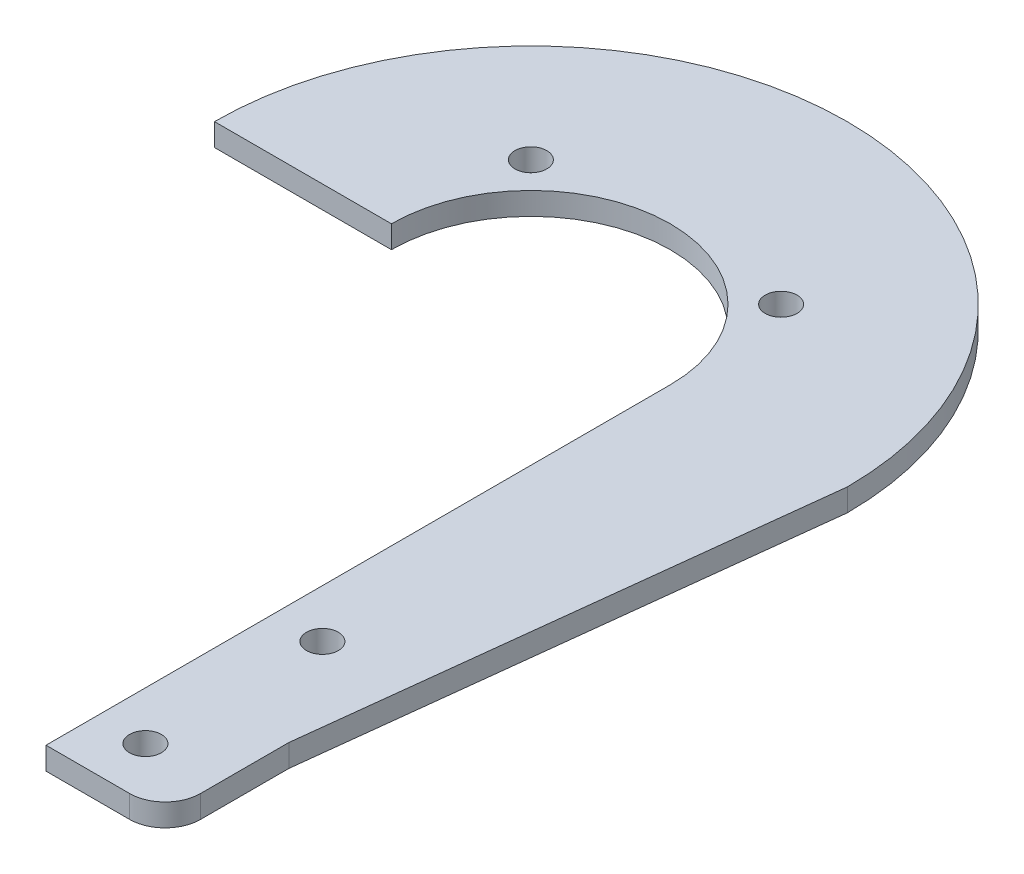
ISO-10303-21;
HEADER;
FILE_DESCRIPTION(('STEP AP214'),'2;1');
FILE_NAME('part.step','',(''),(''),'','','');
FILE_SCHEMA(('AUTOMOTIVE_DESIGN { 1 0 10303 214 1 1 1 1 }'));
ENDSEC;
DATA;
#1=APPLICATION_CONTEXT('core data for automotive mechanical design processes');
#2=APPLICATION_PROTOCOL_DEFINITION('international standard','automotive_design',2000,#1);
#3=PRODUCT_CONTEXT('',#1,'mechanical');
#4=PRODUCT('Part','Part','',(#3));
#5=PRODUCT_RELATED_PRODUCT_CATEGORY('part','',(#4));
#6=PRODUCT_DEFINITION_FORMATION('','',#4);
#7=PRODUCT_DEFINITION_CONTEXT('part definition',#1,'design');
#8=PRODUCT_DEFINITION('design','',#6,#7);
#9=PRODUCT_DEFINITION_SHAPE('','',#8);
#10=(LENGTH_UNIT() NAMED_UNIT(*) SI_UNIT(.MILLI.,.METRE.));
#11=(NAMED_UNIT(*) PLANE_ANGLE_UNIT() SI_UNIT($,.RADIAN.));
#12=(NAMED_UNIT(*) SI_UNIT($,.STERADIAN.) SOLID_ANGLE_UNIT());
#13=UNCERTAINTY_MEASURE_WITH_UNIT(LENGTH_MEASURE(1.E-05),#10,'distance_accuracy_value','');
#14=(GEOMETRIC_REPRESENTATION_CONTEXT(3) GLOBAL_UNCERTAINTY_ASSIGNED_CONTEXT((#13)) GLOBAL_UNIT_ASSIGNED_CONTEXT((#10,
#11,#12)) REPRESENTATION_CONTEXT('',''));
#15=CARTESIAN_POINT('',(0.,0.,0.));
#16=DIRECTION('',(0.,0.,1.));
#17=DIRECTION('',(1.,0.,0.));
#18=AXIS2_PLACEMENT_3D('',#15,#16,#17);
#19=CARTESIAN_POINT('',(0.,3.175,0.));
#20=DIRECTION('',(0.,1.,0.));
#21=DIRECTION('',(0.,0.,1.));
#22=AXIS2_PLACEMENT_3D('',#19,#20,#21);
#23=PLANE('',#22);
#24=CARTESIAN_POINT('',(17.6776695296637,3.175,-17.6776695296637));
#25=DIRECTION('',(0.,1.,0.));
#26=DIRECTION('',(0.,0.,1.));
#27=AXIS2_PLACEMENT_3D('',#24,#25,#26);
#28=CIRCLE('',#27,2.25);
#29=CARTESIAN_POINT('',(17.6776695296637,3.175,-15.4276695296637));
#30=VERTEX_POINT('',#29);
#31=EDGE_CURVE('E196',#30,#30,#28,.T.);
#32=ORIENTED_EDGE('',*,*,#31,.F.);
#33=EDGE_LOOP('',(#32));
#34=FACE_BOUND('',#33,.T.);
#35=CARTESIAN_POINT('',(26.525,3.175,55.975));
#36=DIRECTION('',(0.,1.,0.));
#37=DIRECTION('',(0.,0.,1.));
#38=AXIS2_PLACEMENT_3D('',#35,#36,#37);
#39=CIRCLE('',#38,2.25);
#40=CARTESIAN_POINT('',(26.525,3.175,58.225));
#41=VERTEX_POINT('',#40);
#42=EDGE_CURVE('E142',#41,#41,#39,.T.);
#43=ORIENTED_EDGE('',*,*,#42,.F.);
#44=EDGE_LOOP('',(#43));
#45=FACE_BOUND('',#44,.T.);
#46=DIRECTION('',(0.,0.,1.));
#47=VECTOR('',#46,1.);
#48=CARTESIAN_POINT('',(19.7,3.175,88.2));
#49=LINE('',#48,#47);
#50=CARTESIAN_POINT('',(19.7,3.175,0.));
#51=VERTEX_POINT('',#50);
#52=CARTESIAN_POINT('',(19.7,3.175,88.2));
#53=VERTEX_POINT('',#52);
#54=EDGE_CURVE('E153',#51,#53,#49,.T.);
#55=ORIENTED_EDGE('',*,*,#54,.T.);
#56=DIRECTION('',(1.,0.,0.));
#57=VECTOR('',#56,1.);
#58=CARTESIAN_POINT('',(19.7,3.175,88.2));
#59=LINE('',#58,#57);
#60=CARTESIAN_POINT('',(31.525,3.175,88.2));
#61=VERTEX_POINT('',#60);
#62=EDGE_CURVE('E101',#53,#61,#59,.T.);
#63=ORIENTED_EDGE('',*,*,#62,.T.);
#64=CARTESIAN_POINT('',(31.525,3.175,83.2));
#65=DIRECTION('',(0.,1.,0.));
#66=DIRECTION('',(0.,0.,1.));
#67=AXIS2_PLACEMENT_3D('',#64,#65,#66);
#68=CIRCLE('',#67,5.);
#69=CARTESIAN_POINT('',(36.525,3.175,83.2));
#70=VERTEX_POINT('',#69);
#71=EDGE_CURVE('E168',#61,#70,#68,.T.);
#72=ORIENTED_EDGE('',*,*,#71,.T.);
#73=DIRECTION('',(0.,0.,-1.));
#74=VECTOR('',#73,1.);
#75=CARTESIAN_POINT('',(36.525,3.175,83.2));
#76=LINE('',#75,#74);
#77=CARTESIAN_POINT('',(36.525,3.175,70.7));
#78=VERTEX_POINT('',#77);
#79=EDGE_CURVE('E181',#70,#78,#76,.T.);
#80=ORIENTED_EDGE('',*,*,#79,.T.);
#81=DIRECTION('',(0.114864093907694,0.,-0.993381215813328));
#82=VECTOR('',#81,1.);
#83=CARTESIAN_POINT('',(36.525,3.175,70.7));
#84=LINE('',#83,#82);
#85=CARTESIAN_POINT('',(44.7,3.175,0.));
#86=VERTEX_POINT('',#85);
#87=EDGE_CURVE('E120',#78,#86,#84,.T.);
#88=ORIENTED_EDGE('',*,*,#87,.T.);
#89=CARTESIAN_POINT('',(0.,3.175,0.));
#90=DIRECTION('',(0.,1.,0.));
#91=DIRECTION('',(0.,0.,1.));
#92=AXIS2_PLACEMENT_3D('',#89,#90,#91);
#93=CIRCLE('',#92,44.7);
#94=CARTESIAN_POINT('',(-44.7,3.175,0.));
#95=VERTEX_POINT('',#94);
#96=EDGE_CURVE('E114',#86,#95,#93,.T.);
#97=ORIENTED_EDGE('',*,*,#96,.T.);
#98=DIRECTION('',(1.,0.,0.));
#99=VECTOR('',#98,1.);
#100=CARTESIAN_POINT('',(-44.7,3.175,0.));
#101=LINE('',#100,#99);
#102=CARTESIAN_POINT('',(-19.7,3.175,0.));
#103=VERTEX_POINT('',#102);
#104=EDGE_CURVE('E118',#95,#103,#101,.T.);
#105=ORIENTED_EDGE('',*,*,#104,.T.);
#106=CARTESIAN_POINT('',(0.,3.175,0.));
#107=DIRECTION('',(0.,-1.,0.));
#108=DIRECTION('',(0.,0.,1.));
#109=AXIS2_PLACEMENT_3D('',#106,#107,#108);
#110=CIRCLE('',#109,19.7);
#111=EDGE_CURVE('E58',#103,#51,#110,.T.);
#112=ORIENTED_EDGE('',*,*,#111,.T.);
#113=EDGE_LOOP('',(#55,#63,#72,#80,#88,#97,#105,#112));
#114=FACE_BOUND('',#113,.T.);
#115=CARTESIAN_POINT('',(26.525,3.175,80.975));
#116=DIRECTION('',(0.,1.,0.));
#117=DIRECTION('',(0.,0.,1.));
#118=AXIS2_PLACEMENT_3D('',#115,#116,#117);
#119=CIRCLE('',#118,2.25);
#120=CARTESIAN_POINT('',(26.525,3.175,83.225));
#121=VERTEX_POINT('',#120);
#122=EDGE_CURVE('E190',#121,#121,#119,.T.);
#123=ORIENTED_EDGE('',*,*,#122,.F.);
#124=EDGE_LOOP('',(#123));
#125=FACE_BOUND('',#124,.T.);
#126=CARTESIAN_POINT('',(-17.6776695296638,3.175,-17.6776695296636));
#127=DIRECTION('',(0.,1.,0.));
#128=DIRECTION('',(0.,0.,1.));
#129=AXIS2_PLACEMENT_3D('',#126,#127,#128);
#130=CIRCLE('',#129,2.25);
#131=CARTESIAN_POINT('',(-17.6776695296638,3.175,-15.4276695296636));
#132=VERTEX_POINT('',#131);
#133=EDGE_CURVE('E202',#132,#132,#130,.T.);
#134=ORIENTED_EDGE('',*,*,#133,.F.);
#135=EDGE_LOOP('',(#134));
#136=FACE_BOUND('',#135,.T.);
#137=ADVANCED_FACE('F41',(#34,#45,#114,#125,#136),#23,.T.);
#138=CARTESIAN_POINT('',(0.,0.,0.));
#139=DIRECTION('',(0.,1.,0.));
#140=DIRECTION('',(0.,0.,1.));
#141=AXIS2_PLACEMENT_3D('',#138,#139,#140);
#142=PLANE('',#141);
#143=DIRECTION('',(0.,0.,1.));
#144=VECTOR('',#143,1.);
#145=CARTESIAN_POINT('',(19.7,0.,88.2));
#146=LINE('',#145,#144);
#147=CARTESIAN_POINT('',(19.7,0.,0.));
#148=VERTEX_POINT('',#147);
#149=CARTESIAN_POINT('',(19.7,0.,88.2));
#150=VERTEX_POINT('',#149);
#151=EDGE_CURVE('E138',#148,#150,#146,.T.);
#152=ORIENTED_EDGE('',*,*,#151,.F.);
#153=CARTESIAN_POINT('',(0.,0.,0.));
#154=DIRECTION('',(0.,-1.,0.));
#155=DIRECTION('',(0.,0.,1.));
#156=AXIS2_PLACEMENT_3D('',#153,#154,#155);
#157=CIRCLE('',#156,19.7);
#158=CARTESIAN_POINT('',(-19.7,0.,0.));
#159=VERTEX_POINT('',#158);
#160=EDGE_CURVE('E93',#159,#148,#157,.T.);
#161=ORIENTED_EDGE('',*,*,#160,.F.);
#162=DIRECTION('',(1.,0.,0.));
#163=VECTOR('',#162,1.);
#164=CARTESIAN_POINT('',(-44.7,0.,0.));
#165=LINE('',#164,#163);
#166=CARTESIAN_POINT('',(-44.7,0.,0.));
#167=VERTEX_POINT('',#166);
#168=EDGE_CURVE('E87',#167,#159,#165,.T.);
#169=ORIENTED_EDGE('',*,*,#168,.F.);
#170=CARTESIAN_POINT('',(0.,0.,0.));
#171=DIRECTION('',(0.,1.,0.));
#172=DIRECTION('',(0.,0.,1.));
#173=AXIS2_PLACEMENT_3D('',#170,#171,#172);
#174=CIRCLE('',#173,44.7);
#175=CARTESIAN_POINT('',(44.7,0.,0.));
#176=VERTEX_POINT('',#175);
#177=EDGE_CURVE('E128',#176,#167,#174,.T.);
#178=ORIENTED_EDGE('',*,*,#177,.F.);
#179=DIRECTION('',(0.114864093907694,0.,-0.993381215813328));
#180=VECTOR('',#179,1.);
#181=CARTESIAN_POINT('',(36.525,0.,70.7));
#182=LINE('',#181,#180);
#183=CARTESIAN_POINT('',(36.525,0.,70.7));
#184=VERTEX_POINT('',#183);
#185=EDGE_CURVE('E148',#184,#176,#182,.T.);
#186=ORIENTED_EDGE('',*,*,#185,.F.);
#187=DIRECTION('',(0.,0.,-1.));
#188=VECTOR('',#187,1.);
#189=CARTESIAN_POINT('',(36.525,0.,83.2));
#190=LINE('',#189,#188);
#191=CARTESIAN_POINT('',(36.525,0.,83.2));
#192=VERTEX_POINT('',#191);
#193=EDGE_CURVE('E146',#192,#184,#190,.T.);
#194=ORIENTED_EDGE('',*,*,#193,.F.);
#195=CARTESIAN_POINT('',(31.525,0.,83.2));
#196=DIRECTION('',(0.,1.,0.));
#197=DIRECTION('',(0.,0.,1.));
#198=AXIS2_PLACEMENT_3D('',#195,#196,#197);
#199=CIRCLE('',#198,5.);
#200=CARTESIAN_POINT('',(31.525,0.,88.2));
#201=VERTEX_POINT('',#200);
#202=EDGE_CURVE('E144',#201,#192,#199,.T.);
#203=ORIENTED_EDGE('',*,*,#202,.F.);
#204=DIRECTION('',(1.,0.,0.));
#205=VECTOR('',#204,1.);
#206=CARTESIAN_POINT('',(19.7,0.,88.2));
#207=LINE('',#206,#205);
#208=EDGE_CURVE('E141',#150,#201,#207,.T.);
#209=ORIENTED_EDGE('',*,*,#208,.F.);
#210=EDGE_LOOP('',(#152,#161,#169,#178,#186,#194,#203,#209));
#211=FACE_BOUND('',#210,.T.);
#212=CARTESIAN_POINT('',(26.525,0.,55.975));
#213=DIRECTION('',(0.,1.,0.));
#214=DIRECTION('',(0.,0.,1.));
#215=AXIS2_PLACEMENT_3D('',#212,#213,#214);
#216=CIRCLE('',#215,2.25);
#217=CARTESIAN_POINT('',(26.525,0.,58.225));
#218=VERTEX_POINT('',#217);
#219=EDGE_CURVE('E187',#218,#218,#216,.T.);
#220=ORIENTED_EDGE('',*,*,#219,.T.);
#221=EDGE_LOOP('',(#220));
#222=FACE_BOUND('',#221,.T.);
#223=CARTESIAN_POINT('',(26.525,0.,80.975));
#224=DIRECTION('',(0.,1.,0.));
#225=DIRECTION('',(0.,0.,1.));
#226=AXIS2_PLACEMENT_3D('',#223,#224,#225);
#227=CIRCLE('',#226,2.25);
#228=CARTESIAN_POINT('',(26.525,0.,83.225));
#229=VERTEX_POINT('',#228);
#230=EDGE_CURVE('E193',#229,#229,#227,.T.);
#231=ORIENTED_EDGE('',*,*,#230,.T.);
#232=EDGE_LOOP('',(#231));
#233=FACE_BOUND('',#232,.T.);
#234=CARTESIAN_POINT('',(17.6776695296637,0.,-17.6776695296637));
#235=DIRECTION('',(0.,1.,0.));
#236=DIRECTION('',(0.,0.,1.));
#237=AXIS2_PLACEMENT_3D('',#234,#235,#236);
#238=CIRCLE('',#237,2.25);
#239=CARTESIAN_POINT('',(17.6776695296637,0.,-15.4276695296637));
#240=VERTEX_POINT('',#239);
#241=EDGE_CURVE('E199',#240,#240,#238,.T.);
#242=ORIENTED_EDGE('',*,*,#241,.T.);
#243=EDGE_LOOP('',(#242));
#244=FACE_BOUND('',#243,.T.);
#245=CARTESIAN_POINT('',(-17.6776695296638,0.,-17.6776695296636));
#246=DIRECTION('',(0.,1.,0.));
#247=DIRECTION('',(0.,0.,1.));
#248=AXIS2_PLACEMENT_3D('',#245,#246,#247);
#249=CIRCLE('',#248,2.25);
#250=CARTESIAN_POINT('',(-17.6776695296638,0.,-15.4276695296636));
#251=VERTEX_POINT('',#250);
#252=EDGE_CURVE('E205',#251,#251,#249,.T.);
#253=ORIENTED_EDGE('',*,*,#252,.T.);
#254=EDGE_LOOP('',(#253));
#255=FACE_BOUND('',#254,.T.);
#256=ADVANCED_FACE('F172',(#211,#222,#233,#244,#255),#142,.F.);
#257=CARTESIAN_POINT('',(19.7,3.175,88.2));
#258=DIRECTION('',(1.,0.,0.));
#259=DIRECTION('',(0.,0.,-1.));
#260=AXIS2_PLACEMENT_3D('',#257,#258,#259);
#261=PLANE('',#260);
#262=ORIENTED_EDGE('',*,*,#151,.T.);
#263=DIRECTION('',(0.,-1.,0.));
#264=VECTOR('',#263,1.);
#265=CARTESIAN_POINT('',(19.7,3.175,88.2));
#266=LINE('',#265,#264);
#267=EDGE_CURVE('E11',#53,#150,#266,.T.);
#268=ORIENTED_EDGE('',*,*,#267,.F.);
#269=ORIENTED_EDGE('',*,*,#54,.F.);
#270=DIRECTION('',(0.,-1.,0.));
#271=VECTOR('',#270,1.);
#272=CARTESIAN_POINT('',(19.7,3.175,0.));
#273=LINE('',#272,#271);
#274=EDGE_CURVE('E134',#51,#148,#273,.T.);
#275=ORIENTED_EDGE('',*,*,#274,.T.);
#276=EDGE_LOOP('',(#262,#268,#269,#275));
#277=FACE_BOUND('',#276,.T.);
#278=ADVANCED_FACE('F43',(#277),#261,.F.);
#279=CARTESIAN_POINT('',(19.7,3.175,88.2));
#280=DIRECTION('',(0.,0.,-1.));
#281=DIRECTION('',(-1.,0.,0.));
#282=AXIS2_PLACEMENT_3D('',#279,#280,#281);
#283=PLANE('',#282);
#284=ORIENTED_EDGE('',*,*,#208,.T.);
#285=DIRECTION('',(0.,-1.,0.));
#286=VECTOR('',#285,1.);
#287=CARTESIAN_POINT('',(31.525,3.175,88.2));
#288=LINE('',#287,#286);
#289=EDGE_CURVE('E50',#61,#201,#288,.T.);
#290=ORIENTED_EDGE('',*,*,#289,.F.);
#291=ORIENTED_EDGE('',*,*,#62,.F.);
#292=ORIENTED_EDGE('',*,*,#267,.T.);
#293=EDGE_LOOP('',(#284,#290,#291,#292));
#294=FACE_BOUND('',#293,.T.);
#295=ADVANCED_FACE('F239',(#294),#283,.F.);
#296=CARTESIAN_POINT('',(31.525,3.175,83.2));
#297=DIRECTION('',(0.,-1.,0.));
#298=DIRECTION('',(0.,0.,-1.));
#299=AXIS2_PLACEMENT_3D('',#296,#297,#298);
#300=CYLINDRICAL_SURFACE('',#299,5.);
#301=ORIENTED_EDGE('',*,*,#202,.T.);
#302=DIRECTION('',(0.,-1.,0.));
#303=VECTOR('',#302,1.);
#304=CARTESIAN_POINT('',(36.525,3.175,83.2));
#305=LINE('',#304,#303);
#306=EDGE_CURVE('E160',#70,#192,#305,.T.);
#307=ORIENTED_EDGE('',*,*,#306,.F.);
#308=ORIENTED_EDGE('',*,*,#71,.F.);
#309=ORIENTED_EDGE('',*,*,#289,.T.);
#310=EDGE_LOOP('',(#301,#307,#308,#309));
#311=FACE_BOUND('',#310,.T.);
#312=ADVANCED_FACE('F166',(#311),#300,.T.);
#313=CARTESIAN_POINT('',(36.525,3.175,83.2));
#314=DIRECTION('',(-1.,0.,0.));
#315=DIRECTION('',(0.,0.,1.));
#316=AXIS2_PLACEMENT_3D('',#313,#314,#315);
#317=PLANE('',#316);
#318=ORIENTED_EDGE('',*,*,#193,.T.);
#319=DIRECTION('',(0.,-1.,0.));
#320=VECTOR('',#319,1.);
#321=CARTESIAN_POINT('',(36.525,3.175,70.7));
#322=LINE('',#321,#320);
#323=EDGE_CURVE('E157',#78,#184,#322,.T.);
#324=ORIENTED_EDGE('',*,*,#323,.F.);
#325=ORIENTED_EDGE('',*,*,#79,.F.);
#326=ORIENTED_EDGE('',*,*,#306,.T.);
#327=EDGE_LOOP('',(#318,#324,#325,#326));
#328=FACE_BOUND('',#327,.T.);
#329=ADVANCED_FACE('F177',(#328),#317,.F.);
#330=CARTESIAN_POINT('',(36.525,3.175,70.7));
#331=DIRECTION('',(-0.993381215813327,0.,-0.114864093907694));
#332=DIRECTION('',(-0.114864093907694,0.,0.993381215813328));
#333=AXIS2_PLACEMENT_3D('',#330,#331,#332);
#334=PLANE('',#333);
#335=ORIENTED_EDGE('',*,*,#185,.T.);
#336=DIRECTION('',(0.,-1.,0.));
#337=VECTOR('',#336,1.);
#338=CARTESIAN_POINT('',(44.7,3.175,0.));
#339=LINE('',#338,#337);
#340=EDGE_CURVE('E129',#86,#176,#339,.T.);
#341=ORIENTED_EDGE('',*,*,#340,.F.);
#342=ORIENTED_EDGE('',*,*,#87,.F.);
#343=ORIENTED_EDGE('',*,*,#323,.T.);
#344=EDGE_LOOP('',(#335,#341,#342,#343));
#345=FACE_BOUND('',#344,.T.);
#346=ADVANCED_FACE('F180',(#345),#334,.F.);
#347=CARTESIAN_POINT('',(0.,3.175,0.));
#348=DIRECTION('',(0.,-1.,0.));
#349=DIRECTION('',(0.,0.,-1.));
#350=AXIS2_PLACEMENT_3D('',#347,#348,#349);
#351=CYLINDRICAL_SURFACE('',#350,44.7);
#352=ORIENTED_EDGE('',*,*,#177,.T.);
#353=DIRECTION('',(0.,-1.,0.));
#354=VECTOR('',#353,1.);
#355=CARTESIAN_POINT('',(-44.7,3.175,0.));
#356=LINE('',#355,#354);
#357=EDGE_CURVE('E125',#95,#167,#356,.T.);
#358=ORIENTED_EDGE('',*,*,#357,.F.);
#359=ORIENTED_EDGE('',*,*,#96,.F.);
#360=ORIENTED_EDGE('',*,*,#340,.T.);
#361=EDGE_LOOP('',(#352,#358,#359,#360));
#362=FACE_BOUND('',#361,.T.);
#363=ADVANCED_FACE('F126',(#362),#351,.T.);
#364=CARTESIAN_POINT('',(-44.7,3.175,0.));
#365=DIRECTION('',(0.,0.,-1.));
#366=DIRECTION('',(-1.,0.,0.));
#367=AXIS2_PLACEMENT_3D('',#364,#365,#366);
#368=PLANE('',#367);
#369=ORIENTED_EDGE('',*,*,#168,.T.);
#370=DIRECTION('',(0.,-1.,0.));
#371=VECTOR('',#370,1.);
#372=CARTESIAN_POINT('',(-19.7,3.175,0.));
#373=LINE('',#372,#371);
#374=EDGE_CURVE('E130',#103,#159,#373,.T.);
#375=ORIENTED_EDGE('',*,*,#374,.F.);
#376=ORIENTED_EDGE('',*,*,#104,.F.);
#377=ORIENTED_EDGE('',*,*,#357,.T.);
#378=EDGE_LOOP('',(#369,#375,#376,#377));
#379=FACE_BOUND('',#378,.T.);
#380=ADVANCED_FACE('F132',(#379),#368,.F.);
#381=CARTESIAN_POINT('',(0.,3.175,0.));
#382=DIRECTION('',(0.,-1.,0.));
#383=DIRECTION('',(0.,0.,-1.));
#384=AXIS2_PLACEMENT_3D('',#381,#382,#383);
#385=CYLINDRICAL_SURFACE('',#384,19.7);
#386=ORIENTED_EDGE('',*,*,#160,.T.);
#387=ORIENTED_EDGE('',*,*,#274,.F.);
#388=ORIENTED_EDGE('',*,*,#111,.F.);
#389=ORIENTED_EDGE('',*,*,#374,.T.);
#390=EDGE_LOOP('',(#386,#387,#388,#389));
#391=FACE_BOUND('',#390,.T.);
#392=ADVANCED_FACE('F227',(#391),#385,.F.);
#393=CARTESIAN_POINT('',(26.525,3.175,55.975));
#394=DIRECTION('',(0.,-1.,0.));
#395=DIRECTION('',(0.,0.,-1.));
#396=AXIS2_PLACEMENT_3D('',#393,#394,#395);
#397=CYLINDRICAL_SURFACE('',#396,2.25);
#398=ORIENTED_EDGE('',*,*,#42,.T.);
#399=EDGE_LOOP('',(#398));
#400=FACE_BOUND('',#399,.T.);
#401=ORIENTED_EDGE('',*,*,#219,.F.);
#402=EDGE_LOOP('',(#401));
#403=FACE_BOUND('',#402,.T.);
#404=ADVANCED_FACE('F224',(#400,#403),#397,.F.);
#405=CARTESIAN_POINT('',(26.525,3.175,80.975));
#406=DIRECTION('',(0.,-1.,0.));
#407=DIRECTION('',(0.,0.,-1.));
#408=AXIS2_PLACEMENT_3D('',#405,#406,#407);
#409=CYLINDRICAL_SURFACE('',#408,2.25);
#410=ORIENTED_EDGE('',*,*,#122,.T.);
#411=EDGE_LOOP('',(#410));
#412=FACE_BOUND('',#411,.T.);
#413=ORIENTED_EDGE('',*,*,#230,.F.);
#414=EDGE_LOOP('',(#413));
#415=FACE_BOUND('',#414,.T.);
#416=ADVANCED_FACE('F302',(#412,#415),#409,.F.);
#417=CARTESIAN_POINT('',(17.6776695296637,3.175,-17.6776695296637));
#418=DIRECTION('',(0.,-1.,0.));
#419=DIRECTION('',(0.,0.,-1.));
#420=AXIS2_PLACEMENT_3D('',#417,#418,#419);
#421=CYLINDRICAL_SURFACE('',#420,2.25);
#422=ORIENTED_EDGE('',*,*,#31,.T.);
#423=EDGE_LOOP('',(#422));
#424=FACE_BOUND('',#423,.T.);
#425=ORIENTED_EDGE('',*,*,#241,.F.);
#426=EDGE_LOOP('',(#425));
#427=FACE_BOUND('',#426,.T.);
#428=ADVANCED_FACE('F310',(#424,#427),#421,.F.);
#429=CARTESIAN_POINT('',(-17.6776695296638,3.175,-17.6776695296636));
#430=DIRECTION('',(0.,-1.,0.));
#431=DIRECTION('',(0.,0.,-1.));
#432=AXIS2_PLACEMENT_3D('',#429,#430,#431);
#433=CYLINDRICAL_SURFACE('',#432,2.25);
#434=ORIENTED_EDGE('',*,*,#133,.T.);
#435=EDGE_LOOP('',(#434));
#436=FACE_BOUND('',#435,.T.);
#437=ORIENTED_EDGE('',*,*,#252,.F.);
#438=EDGE_LOOP('',(#437));
#439=FACE_BOUND('',#438,.T.);
#440=ADVANCED_FACE('F211',(#436,#439),#433,.F.);
#441=CLOSED_SHELL('',(#137,#256,#278,#295,#312,#329,#346,#363,#380,#392,#404,#416,#428,#440));
#442=MANIFOLD_SOLID_BREP('B2',#441);
#443=ADVANCED_BREP_SHAPE_REPRESENTATION('',(#18,#442),#14);
#444=SHAPE_DEFINITION_REPRESENTATION(#9,#443);
ENDSEC;
END-ISO-10303-21;
